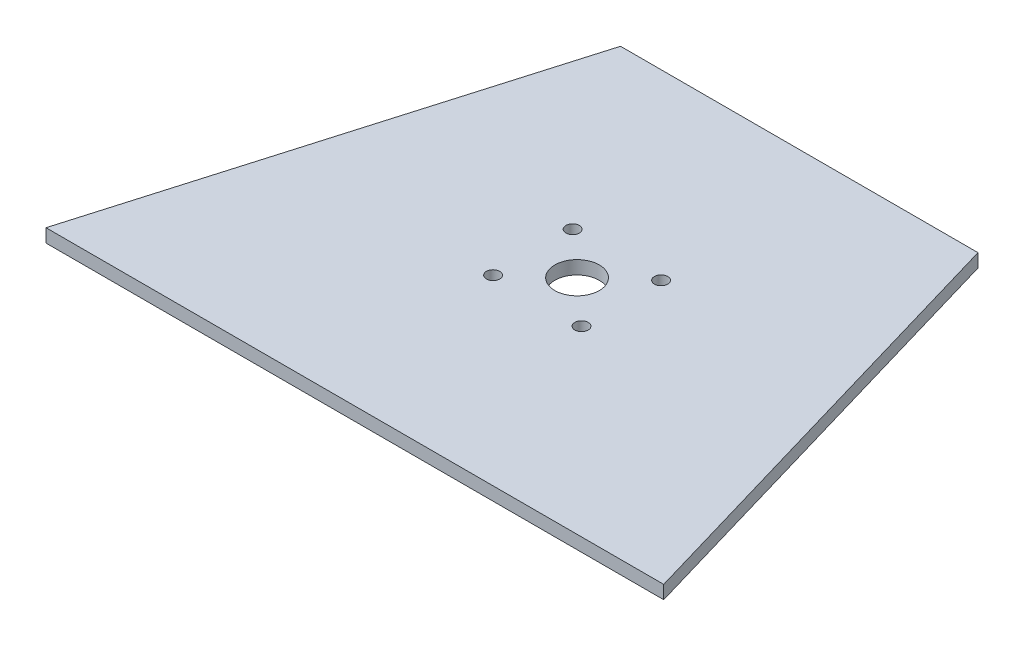
ISO-10303-21;
HEADER;
FILE_DESCRIPTION(('STEP AP214'),'2;1');
FILE_NAME('part.step','',(''),(''),'','','');
FILE_SCHEMA(('AUTOMOTIVE_DESIGN { 1 0 10303 214 1 1 1 1 }'));
ENDSEC;
DATA;
#1=APPLICATION_CONTEXT('core data for automotive mechanical design processes');
#2=APPLICATION_PROTOCOL_DEFINITION('international standard','automotive_design',2000,#1);
#3=PRODUCT_CONTEXT('',#1,'mechanical');
#4=PRODUCT('Part','Part','',(#3));
#5=PRODUCT_RELATED_PRODUCT_CATEGORY('part','',(#4));
#6=PRODUCT_DEFINITION_FORMATION('','',#4);
#7=PRODUCT_DEFINITION_CONTEXT('part definition',#1,'design');
#8=PRODUCT_DEFINITION('design','',#6,#7);
#9=PRODUCT_DEFINITION_SHAPE('','',#8);
#10=(LENGTH_UNIT() NAMED_UNIT(*) SI_UNIT(.MILLI.,.METRE.));
#11=(NAMED_UNIT(*) PLANE_ANGLE_UNIT() SI_UNIT($,.RADIAN.));
#12=(NAMED_UNIT(*) SI_UNIT($,.STERADIAN.) SOLID_ANGLE_UNIT());
#13=UNCERTAINTY_MEASURE_WITH_UNIT(LENGTH_MEASURE(1.E-05),#10,'distance_accuracy_value','');
#14=(GEOMETRIC_REPRESENTATION_CONTEXT(3) GLOBAL_UNCERTAINTY_ASSIGNED_CONTEXT((#13)) GLOBAL_UNIT_ASSIGNED_CONTEXT((#10,
#11,#12)) REPRESENTATION_CONTEXT('',''));
#15=CARTESIAN_POINT('',(0.,0.,0.));
#16=DIRECTION('',(0.,0.,1.));
#17=DIRECTION('',(1.,0.,0.));
#18=AXIS2_PLACEMENT_3D('',#15,#16,#17);
#19=CARTESIAN_POINT('',(0.,3.,0.));
#20=DIRECTION('',(0.959707262339068,0.,0.281001727065248));
#21=DIRECTION('',(0.281001727065248,0.,-0.959707262339068));
#22=AXIS2_PLACEMENT_3D('',#19,#20,#21);
#23=PLANE('',#22);
#24=DIRECTION('',(-0.281001727065248,0.,0.959707262339068));
#25=VECTOR('',#24,1.);
#26=CARTESIAN_POINT('',(0.,0.,0.));
#27=LINE('',#26,#25);
#28=CARTESIAN_POINT('',(29.2799417168492,0.,-100.));
#29=VERTEX_POINT('',#28);
#30=CARTESIAN_POINT('',(0.,0.,0.));
#31=VERTEX_POINT('',#30);
#32=EDGE_CURVE('E104',#29,#31,#27,.T.);
#33=ORIENTED_EDGE('',*,*,#32,.T.);
#34=DIRECTION('',(0.,-1.,0.));
#35=VECTOR('',#34,1.);
#36=CARTESIAN_POINT('',(0.,3.,0.));
#37=LINE('',#36,#35);
#38=CARTESIAN_POINT('',(0.,3.,0.));
#39=VERTEX_POINT('',#38);
#40=EDGE_CURVE('E11',#39,#31,#37,.T.);
#41=ORIENTED_EDGE('',*,*,#40,.F.);
#42=DIRECTION('',(-0.281001727065248,0.,0.959707262339068));
#43=VECTOR('',#42,1.);
#44=CARTESIAN_POINT('',(0.,3.,0.));
#45=LINE('',#44,#43);
#46=CARTESIAN_POINT('',(29.2799417168492,3.,-100.));
#47=VERTEX_POINT('',#46);
#48=EDGE_CURVE('E92',#47,#39,#45,.T.);
#49=ORIENTED_EDGE('',*,*,#48,.F.);
#50=DIRECTION('',(0.,-1.,0.));
#51=VECTOR('',#50,1.);
#52=CARTESIAN_POINT('',(29.2799417168492,3.,-100.));
#53=LINE('',#52,#51);
#54=EDGE_CURVE('E100',#47,#29,#53,.T.);
#55=ORIENTED_EDGE('',*,*,#54,.T.);
#56=EDGE_LOOP('',(#33,#41,#49,#55));
#57=FACE_BOUND('',#56,.T.);
#58=ADVANCED_FACE('F41',(#57),#23,.F.);
#59=CARTESIAN_POINT('',(0.,3.,0.));
#60=DIRECTION('',(0.,0.,-1.));
#61=DIRECTION('',(-1.,0.,0.));
#62=AXIS2_PLACEMENT_3D('',#59,#60,#61);
#63=PLANE('',#62);
#64=DIRECTION('',(1.,0.,0.));
#65=VECTOR('',#64,1.);
#66=CARTESIAN_POINT('',(0.,0.,0.));
#67=LINE('',#66,#65);
#68=CARTESIAN_POINT('',(139.,0.,0.));
#69=VERTEX_POINT('',#68);
#70=EDGE_CURVE('E96',#31,#69,#67,.T.);
#71=ORIENTED_EDGE('',*,*,#70,.T.);
#72=DIRECTION('',(0.,-1.,0.));
#73=VECTOR('',#72,1.);
#74=CARTESIAN_POINT('',(139.,3.,0.));
#75=LINE('',#74,#73);
#76=CARTESIAN_POINT('',(139.,3.,0.));
#77=VERTEX_POINT('',#76);
#78=EDGE_CURVE('E49',#77,#69,#75,.T.);
#79=ORIENTED_EDGE('',*,*,#78,.F.);
#80=DIRECTION('',(1.,0.,0.));
#81=VECTOR('',#80,1.);
#82=CARTESIAN_POINT('',(0.,3.,0.));
#83=LINE('',#82,#81);
#84=EDGE_CURVE('E87',#39,#77,#83,.T.);
#85=ORIENTED_EDGE('',*,*,#84,.F.);
#86=ORIENTED_EDGE('',*,*,#40,.T.);
#87=EDGE_LOOP('',(#71,#79,#85,#86));
#88=FACE_BOUND('',#87,.T.);
#89=ADVANCED_FACE('F95',(#88),#63,.F.);
#90=CARTESIAN_POINT('',(139.,3.,0.));
#91=DIRECTION('',(-0.959707262339066,0.,0.281001727065255));
#92=DIRECTION('',(0.281001727065255,0.,0.959707262339066));
#93=AXIS2_PLACEMENT_3D('',#90,#91,#92);
#94=PLANE('',#93);
#95=DIRECTION('',(-0.281001727065255,0.,-0.959707262339066));
#96=VECTOR('',#95,1.);
#97=CARTESIAN_POINT('',(139.,0.,0.));
#98=LINE('',#97,#96);
#99=CARTESIAN_POINT('',(109.72005828315,0.,-100.));
#100=VERTEX_POINT('',#99);
#101=EDGE_CURVE('E74',#69,#100,#98,.T.);
#102=ORIENTED_EDGE('',*,*,#101,.T.);
#103=DIRECTION('',(0.,-1.,0.));
#104=VECTOR('',#103,1.);
#105=CARTESIAN_POINT('',(109.72005828315,3.,-100.));
#106=LINE('',#105,#104);
#107=CARTESIAN_POINT('',(109.72005828315,3.,-100.));
#108=VERTEX_POINT('',#107);
#109=EDGE_CURVE('E97',#108,#100,#106,.T.);
#110=ORIENTED_EDGE('',*,*,#109,.F.);
#111=DIRECTION('',(-0.281001727065255,0.,-0.959707262339066));
#112=VECTOR('',#111,1.);
#113=CARTESIAN_POINT('',(139.,3.,0.));
#114=LINE('',#113,#112);
#115=EDGE_CURVE('E90',#77,#108,#114,.T.);
#116=ORIENTED_EDGE('',*,*,#115,.F.);
#117=ORIENTED_EDGE('',*,*,#78,.T.);
#118=EDGE_LOOP('',(#102,#110,#116,#117));
#119=FACE_BOUND('',#118,.T.);
#120=ADVANCED_FACE('F98',(#119),#94,.F.);
#121=CARTESIAN_POINT('',(29.2799417168492,3.,-100.));
#122=DIRECTION('',(0.,0.,1.));
#123=DIRECTION('',(1.,0.,0.));
#124=AXIS2_PLACEMENT_3D('',#121,#122,#123);
#125=PLANE('',#124);
#126=DIRECTION('',(-1.,0.,0.));
#127=VECTOR('',#126,1.);
#128=CARTESIAN_POINT('',(29.2799417168492,0.,-100.));
#129=LINE('',#128,#127);
#130=EDGE_CURVE('E80',#100,#29,#129,.T.);
#131=ORIENTED_EDGE('',*,*,#130,.T.);
#132=ORIENTED_EDGE('',*,*,#54,.F.);
#133=DIRECTION('',(-1.,0.,0.));
#134=VECTOR('',#133,1.);
#135=CARTESIAN_POINT('',(29.2799417168492,3.,-100.));
#136=LINE('',#135,#134);
#137=EDGE_CURVE('E57',#108,#47,#136,.T.);
#138=ORIENTED_EDGE('',*,*,#137,.F.);
#139=ORIENTED_EDGE('',*,*,#109,.T.);
#140=EDGE_LOOP('',(#131,#132,#138,#139));
#141=FACE_BOUND('',#140,.T.);
#142=ADVANCED_FACE('F112',(#141),#125,.F.);
#143=CARTESIAN_POINT('',(0.,3.,0.));
#144=DIRECTION('',(0.,-1.,0.));
#145=DIRECTION('',(0.,0.,-1.));
#146=AXIS2_PLACEMENT_3D('',#143,#144,#145);
#147=PLANE('',#146);
#148=CARTESIAN_POINT('',(59.5499999999989,3.,-41.0499999999961));
#149=DIRECTION('',(0.,1.,0.));
#150=DIRECTION('',(0.,0.,1.));
#151=AXIS2_PLACEMENT_3D('',#148,#149,#150);
#152=CIRCLE('',#151,1.5);
#153=CARTESIAN_POINT('',(59.5499999999989,3.,-39.5499999999961));
#154=VERTEX_POINT('',#153);
#155=EDGE_CURVE('E144',#154,#154,#152,.T.);
#156=ORIENTED_EDGE('',*,*,#155,.F.);
#157=EDGE_LOOP('',(#156));
#158=FACE_BOUND('',#157,.T.);
#159=CARTESIAN_POINT('',(59.5499999999988,3.,-58.9499999999961));
#160=DIRECTION('',(0.,1.,0.));
#161=DIRECTION('',(0.,0.,1.));
#162=AXIS2_PLACEMENT_3D('',#159,#160,#161);
#163=CIRCLE('',#162,1.5);
#164=CARTESIAN_POINT('',(59.5499999999988,3.,-57.4499999999961));
#165=VERTEX_POINT('',#164);
#166=EDGE_CURVE('E138',#165,#165,#163,.T.);
#167=ORIENTED_EDGE('',*,*,#166,.F.);
#168=EDGE_LOOP('',(#167));
#169=FACE_BOUND('',#168,.T.);
#170=CARTESIAN_POINT('',(79.4499999999988,3.,-58.9499999999961));
#171=DIRECTION('',(0.,1.,0.));
#172=DIRECTION('',(0.,0.,1.));
#173=AXIS2_PLACEMENT_3D('',#170,#171,#172);
#174=CIRCLE('',#173,1.5);
#175=CARTESIAN_POINT('',(79.4499999999988,3.,-57.4499999999961));
#176=VERTEX_POINT('',#175);
#177=EDGE_CURVE('E132',#176,#176,#174,.T.);
#178=ORIENTED_EDGE('',*,*,#177,.F.);
#179=EDGE_LOOP('',(#178));
#180=FACE_BOUND('',#179,.T.);
#181=CARTESIAN_POINT('',(79.4499999999988,3.,-41.0499999999961));
#182=DIRECTION('',(0.,1.,0.));
#183=DIRECTION('',(0.,0.,1.));
#184=AXIS2_PLACEMENT_3D('',#181,#182,#183);
#185=CIRCLE('',#184,1.5);
#186=CARTESIAN_POINT('',(79.4499999999988,3.,-39.5499999999961));
#187=VERTEX_POINT('',#186);
#188=EDGE_CURVE('E126',#187,#187,#185,.T.);
#189=ORIENTED_EDGE('',*,*,#188,.F.);
#190=EDGE_LOOP('',(#189));
#191=FACE_BOUND('',#190,.T.);
#192=CARTESIAN_POINT('',(69.4999999999993,3.,-50.0000000000002));
#193=DIRECTION('',(0.,1.,0.));
#194=DIRECTION('',(0.,0.,1.));
#195=AXIS2_PLACEMENT_3D('',#192,#193,#194);
#196=CIRCLE('',#195,4.99999999999999);
#197=CARTESIAN_POINT('',(69.4999999999993,3.,-45.0000000000002));
#198=VERTEX_POINT('',#197);
#199=EDGE_CURVE('E120',#198,#198,#196,.T.);
#200=ORIENTED_EDGE('',*,*,#199,.F.);
#201=EDGE_LOOP('',(#200));
#202=FACE_BOUND('',#201,.T.);
#203=ORIENTED_EDGE('',*,*,#48,.T.);
#204=ORIENTED_EDGE('',*,*,#84,.T.);
#205=ORIENTED_EDGE('',*,*,#115,.T.);
#206=ORIENTED_EDGE('',*,*,#137,.T.);
#207=EDGE_LOOP('',(#203,#204,#205,#206));
#208=FACE_BOUND('',#207,.T.);
#209=ADVANCED_FACE('F88',(#158,#169,#180,#191,#202,#208),#147,.F.);
#210=CARTESIAN_POINT('',(0.,0.,0.));
#211=DIRECTION('',(0.,-1.,0.));
#212=DIRECTION('',(0.,0.,-1.));
#213=AXIS2_PLACEMENT_3D('',#210,#211,#212);
#214=PLANE('',#213);
#215=CARTESIAN_POINT('',(59.5499999999989,0.,-41.0499999999961));
#216=DIRECTION('',(0.,-1.,0.));
#217=DIRECTION('',(0.,0.,-1.));
#218=AXIS2_PLACEMENT_3D('',#215,#216,#217);
#219=CIRCLE('',#218,1.5);
#220=CARTESIAN_POINT('',(59.5499999999989,0.,-42.5499999999961));
#221=VERTEX_POINT('',#220);
#222=EDGE_CURVE('E141',#221,#221,#219,.T.);
#223=ORIENTED_EDGE('',*,*,#222,.F.);
#224=EDGE_LOOP('',(#223));
#225=FACE_BOUND('',#224,.T.);
#226=CARTESIAN_POINT('',(59.5499999999988,0.,-58.9499999999961));
#227=DIRECTION('',(0.,-1.,0.));
#228=DIRECTION('',(0.,0.,-1.));
#229=AXIS2_PLACEMENT_3D('',#226,#227,#228);
#230=CIRCLE('',#229,1.5);
#231=CARTESIAN_POINT('',(59.5499999999988,0.,-60.4499999999961));
#232=VERTEX_POINT('',#231);
#233=EDGE_CURVE('E135',#232,#232,#230,.T.);
#234=ORIENTED_EDGE('',*,*,#233,.F.);
#235=EDGE_LOOP('',(#234));
#236=FACE_BOUND('',#235,.T.);
#237=CARTESIAN_POINT('',(79.4499999999988,0.,-58.9499999999961));
#238=DIRECTION('',(0.,-1.,0.));
#239=DIRECTION('',(0.,0.,-1.));
#240=AXIS2_PLACEMENT_3D('',#237,#238,#239);
#241=CIRCLE('',#240,1.5);
#242=CARTESIAN_POINT('',(79.4499999999988,0.,-60.4499999999961));
#243=VERTEX_POINT('',#242);
#244=EDGE_CURVE('E129',#243,#243,#241,.T.);
#245=ORIENTED_EDGE('',*,*,#244,.F.);
#246=EDGE_LOOP('',(#245));
#247=FACE_BOUND('',#246,.T.);
#248=CARTESIAN_POINT('',(79.4499999999988,0.,-41.0499999999961));
#249=DIRECTION('',(0.,-1.,0.));
#250=DIRECTION('',(0.,0.,-1.));
#251=AXIS2_PLACEMENT_3D('',#248,#249,#250);
#252=CIRCLE('',#251,1.5);
#253=CARTESIAN_POINT('',(79.4499999999988,0.,-42.5499999999961));
#254=VERTEX_POINT('',#253);
#255=EDGE_CURVE('E123',#254,#254,#252,.T.);
#256=ORIENTED_EDGE('',*,*,#255,.F.);
#257=EDGE_LOOP('',(#256));
#258=FACE_BOUND('',#257,.T.);
#259=CARTESIAN_POINT('',(69.4999999999993,0.,-50.0000000000002));
#260=DIRECTION('',(0.,-1.,0.));
#261=DIRECTION('',(0.,0.,-1.));
#262=AXIS2_PLACEMENT_3D('',#259,#260,#261);
#263=CIRCLE('',#262,5.);
#264=CARTESIAN_POINT('',(69.4999999999993,0.,-55.0000000000002));
#265=VERTEX_POINT('',#264);
#266=EDGE_CURVE('E107',#265,#265,#263,.T.);
#267=ORIENTED_EDGE('',*,*,#266,.F.);
#268=EDGE_LOOP('',(#267));
#269=FACE_BOUND('',#268,.T.);
#270=ORIENTED_EDGE('',*,*,#32,.F.);
#271=ORIENTED_EDGE('',*,*,#130,.F.);
#272=ORIENTED_EDGE('',*,*,#101,.F.);
#273=ORIENTED_EDGE('',*,*,#70,.F.);
#274=EDGE_LOOP('',(#270,#271,#272,#273));
#275=FACE_BOUND('',#274,.T.);
#276=ADVANCED_FACE('F115',(#225,#236,#247,#258,#269,#275),#214,.T.);
#277=CARTESIAN_POINT('',(69.4999999999993,3.,-50.0000000000002));
#278=DIRECTION('',(0.,1.,0.));
#279=DIRECTION('',(0.,0.,1.));
#280=AXIS2_PLACEMENT_3D('',#277,#278,#279);
#281=CYLINDRICAL_SURFACE('',#280,5.);
#282=ORIENTED_EDGE('',*,*,#199,.T.);
#283=EDGE_LOOP('',(#282));
#284=FACE_BOUND('',#283,.T.);
#285=ORIENTED_EDGE('',*,*,#266,.T.);
#286=EDGE_LOOP('',(#285));
#287=FACE_BOUND('',#286,.T.);
#288=ADVANCED_FACE('F162',(#284,#287),#281,.F.);
#289=CARTESIAN_POINT('',(79.4499999999988,3.,-41.0499999999961));
#290=DIRECTION('',(0.,1.,0.));
#291=DIRECTION('',(0.,0.,1.));
#292=AXIS2_PLACEMENT_3D('',#289,#290,#291);
#293=CYLINDRICAL_SURFACE('',#292,1.5);
#294=ORIENTED_EDGE('',*,*,#188,.T.);
#295=EDGE_LOOP('',(#294));
#296=FACE_BOUND('',#295,.T.);
#297=ORIENTED_EDGE('',*,*,#255,.T.);
#298=EDGE_LOOP('',(#297));
#299=FACE_BOUND('',#298,.T.);
#300=ADVANCED_FACE('F165',(#296,#299),#293,.F.);
#301=CARTESIAN_POINT('',(79.4499999999988,3.,-58.9499999999961));
#302=DIRECTION('',(0.,1.,0.));
#303=DIRECTION('',(0.,0.,1.));
#304=AXIS2_PLACEMENT_3D('',#301,#302,#303);
#305=CYLINDRICAL_SURFACE('',#304,1.5);
#306=ORIENTED_EDGE('',*,*,#177,.T.);
#307=EDGE_LOOP('',(#306));
#308=FACE_BOUND('',#307,.T.);
#309=ORIENTED_EDGE('',*,*,#244,.T.);
#310=EDGE_LOOP('',(#309));
#311=FACE_BOUND('',#310,.T.);
#312=ADVANCED_FACE('F210',(#308,#311),#305,.F.);
#313=CARTESIAN_POINT('',(59.5499999999988,3.,-58.9499999999961));
#314=DIRECTION('',(0.,1.,0.));
#315=DIRECTION('',(0.,0.,1.));
#316=AXIS2_PLACEMENT_3D('',#313,#314,#315);
#317=CYLINDRICAL_SURFACE('',#316,1.5);
#318=ORIENTED_EDGE('',*,*,#166,.T.);
#319=EDGE_LOOP('',(#318));
#320=FACE_BOUND('',#319,.T.);
#321=ORIENTED_EDGE('',*,*,#233,.T.);
#322=EDGE_LOOP('',(#321));
#323=FACE_BOUND('',#322,.T.);
#324=ADVANCED_FACE('F218',(#320,#323),#317,.F.);
#325=CARTESIAN_POINT('',(59.5499999999989,3.,-41.0499999999961));
#326=DIRECTION('',(0.,1.,0.));
#327=DIRECTION('',(0.,0.,1.));
#328=AXIS2_PLACEMENT_3D('',#325,#326,#327);
#329=CYLINDRICAL_SURFACE('',#328,1.5);
#330=ORIENTED_EDGE('',*,*,#155,.T.);
#331=EDGE_LOOP('',(#330));
#332=FACE_BOUND('',#331,.T.);
#333=ORIENTED_EDGE('',*,*,#222,.T.);
#334=EDGE_LOOP('',(#333));
#335=FACE_BOUND('',#334,.T.);
#336=ADVANCED_FACE('F148',(#332,#335),#329,.F.);
#337=CLOSED_SHELL('',(#58,#89,#120,#142,#209,#276,#288,#300,#312,#324,#336));
#338=MANIFOLD_SOLID_BREP('B2',#337);
#339=ADVANCED_BREP_SHAPE_REPRESENTATION('',(#18,#338),#14);
#340=SHAPE_DEFINITION_REPRESENTATION(#9,#339);
ENDSEC;
END-ISO-10303-21;
